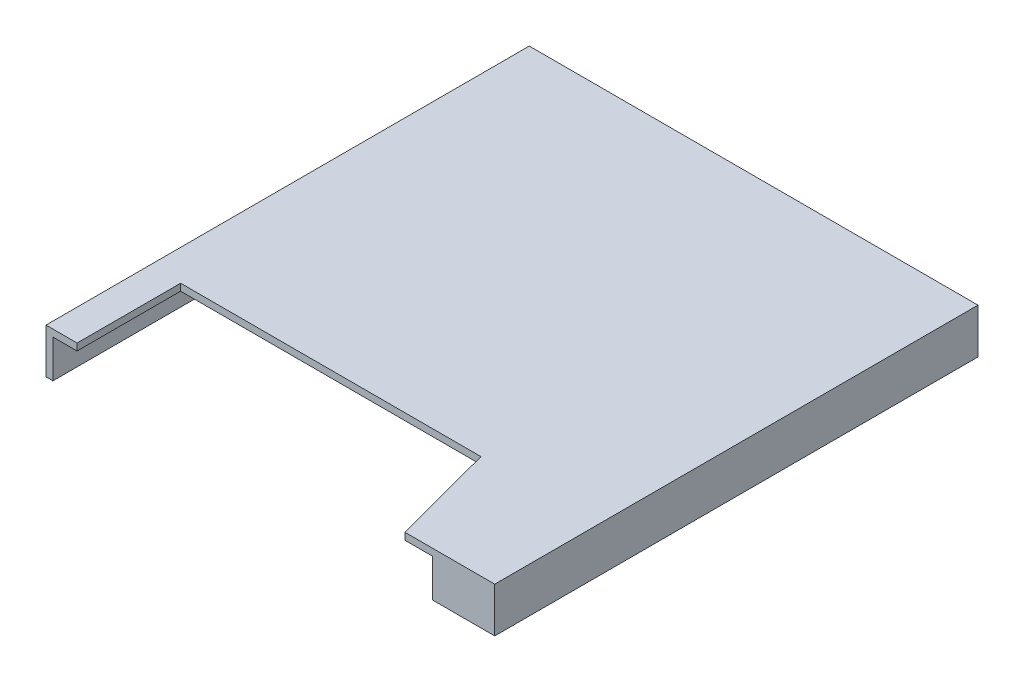
ISO-10303-21;
HEADER;
FILE_DESCRIPTION(('STEP AP214'),'2;1');
FILE_NAME('part.step','',(''),(''),'','','');
FILE_SCHEMA(('AUTOMOTIVE_DESIGN { 1 0 10303 214 1 1 1 1 }'));
ENDSEC;
DATA;
#1=APPLICATION_CONTEXT('core data for automotive mechanical design processes');
#2=APPLICATION_PROTOCOL_DEFINITION('international standard','automotive_design',2000,#1);
#3=PRODUCT_CONTEXT('',#1,'mechanical');
#4=PRODUCT('Part','Part','',(#3));
#5=PRODUCT_RELATED_PRODUCT_CATEGORY('part','',(#4));
#6=PRODUCT_DEFINITION_FORMATION('','',#4);
#7=PRODUCT_DEFINITION_CONTEXT('part definition',#1,'design');
#8=PRODUCT_DEFINITION('design','',#6,#7);
#9=PRODUCT_DEFINITION_SHAPE('','',#8);
#10=(LENGTH_UNIT() NAMED_UNIT(*) SI_UNIT(.MILLI.,.METRE.));
#11=(NAMED_UNIT(*) PLANE_ANGLE_UNIT() SI_UNIT($,.RADIAN.));
#12=(NAMED_UNIT(*) SI_UNIT($,.STERADIAN.) SOLID_ANGLE_UNIT());
#13=UNCERTAINTY_MEASURE_WITH_UNIT(LENGTH_MEASURE(1.E-05),#10,'distance_accuracy_value','');
#14=(GEOMETRIC_REPRESENTATION_CONTEXT(3) GLOBAL_UNCERTAINTY_ASSIGNED_CONTEXT((#13)) GLOBAL_UNIT_ASSIGNED_CONTEXT((#10,
#11,#12)) REPRESENTATION_CONTEXT('',''));
#15=CARTESIAN_POINT('',(0.,0.,0.));
#16=DIRECTION('',(0.,0.,1.));
#17=DIRECTION('',(1.,0.,0.));
#18=AXIS2_PLACEMENT_3D('',#15,#16,#17);
#19=CARTESIAN_POINT('',(-6.3,0.,-7.));
#20=DIRECTION('',(-1.,0.,0.));
#21=DIRECTION('',(0.,0.,1.));
#22=AXIS2_PLACEMENT_3D('',#19,#20,#21);
#23=PLANE('',#22);
#24=DIRECTION('',(0.,0.,1.));
#25=VECTOR('',#24,1.);
#26=CARTESIAN_POINT('',(-6.3,1.1,0.));
#27=LINE('',#26,#25);
#28=CARTESIAN_POINT('',(-6.3,1.1,-6.8));
#29=VERTEX_POINT('',#28);
#30=CARTESIAN_POINT('',(-6.3,1.1,7.));
#31=VERTEX_POINT('',#30);
#32=EDGE_CURVE('E143',#29,#31,#27,.T.);
#33=ORIENTED_EDGE('',*,*,#32,.T.);
#34=DIRECTION('',(0.,1.,0.));
#35=VECTOR('',#34,1.);
#36=CARTESIAN_POINT('',(-6.3,0.,7.));
#37=LINE('',#36,#35);
#38=CARTESIAN_POINT('',(-6.3,0.,7.));
#39=VERTEX_POINT('',#38);
#40=EDGE_CURVE('E19',#39,#31,#37,.T.);
#41=ORIENTED_EDGE('',*,*,#40,.F.);
#42=DIRECTION('',(0.,0.,1.));
#43=VECTOR('',#42,1.);
#44=CARTESIAN_POINT('',(-6.3,0.,0.));
#45=LINE('',#44,#43);
#46=CARTESIAN_POINT('',(-6.3,0.,-6.8));
#47=VERTEX_POINT('',#46);
#48=EDGE_CURVE('E179',#39,#47,#45,.F.);
#49=ORIENTED_EDGE('',*,*,#48,.T.);
#50=DIRECTION('',(0.,1.,0.));
#51=VECTOR('',#50,1.);
#52=CARTESIAN_POINT('',(-6.3,0.,-6.8));
#53=LINE('',#52,#51);
#54=EDGE_CURVE('E147',#47,#29,#53,.T.);
#55=ORIENTED_EDGE('',*,*,#54,.T.);
#56=EDGE_LOOP('',(#33,#41,#49,#55));
#57=FACE_BOUND('',#56,.T.);
#58=ADVANCED_FACE('F16',(#57),#23,.F.);
#59=CARTESIAN_POINT('',(6.5,0.,-6.8));
#60=DIRECTION('',(0.,0.,-1.));
#61=DIRECTION('',(-1.,0.,0.));
#62=AXIS2_PLACEMENT_3D('',#59,#60,#61);
#63=PLANE('',#62);
#64=DIRECTION('',(1.,0.,0.));
#65=VECTOR('',#64,1.);
#66=CARTESIAN_POINT('',(0.,1.1,-6.8));
#67=LINE('',#66,#65);
#68=CARTESIAN_POINT('',(6.3,1.1,-6.8));
#69=VERTEX_POINT('',#68);
#70=EDGE_CURVE('E141',#69,#29,#67,.F.);
#71=ORIENTED_EDGE('',*,*,#70,.T.);
#72=ORIENTED_EDGE('',*,*,#54,.F.);
#73=DIRECTION('',(1.,0.,0.));
#74=VECTOR('',#73,1.);
#75=CARTESIAN_POINT('',(0.,0.,-6.8));
#76=LINE('',#75,#74);
#77=CARTESIAN_POINT('',(6.3,0.,-6.8));
#78=VERTEX_POINT('',#77);
#79=EDGE_CURVE('E177',#47,#78,#76,.T.);
#80=ORIENTED_EDGE('',*,*,#79,.T.);
#81=DIRECTION('',(0.,1.,0.));
#82=VECTOR('',#81,1.);
#83=CARTESIAN_POINT('',(6.3,0.,-6.8));
#84=LINE('',#83,#82);
#85=EDGE_CURVE('E114',#78,#69,#84,.T.);
#86=ORIENTED_EDGE('',*,*,#85,.T.);
#87=EDGE_LOOP('',(#71,#72,#80,#86));
#88=FACE_BOUND('',#87,.T.);
#89=ADVANCED_FACE('F422',(#88),#63,.F.);
#90=CARTESIAN_POINT('',(6.3,0.,7.));
#91=DIRECTION('',(1.,0.,0.));
#92=DIRECTION('',(0.,0.,-1.));
#93=AXIS2_PLACEMENT_3D('',#90,#91,#92);
#94=PLANE('',#93);
#95=ORIENTED_EDGE('',*,*,#85,.F.);
#96=DIRECTION('',(0.,0.,1.));
#97=VECTOR('',#96,1.);
#98=CARTESIAN_POINT('',(6.3,0.,0.));
#99=LINE('',#98,#97);
#100=CARTESIAN_POINT('',(6.3,0.,6.8));
#101=VERTEX_POINT('',#100);
#102=EDGE_CURVE('E126',#78,#101,#99,.T.);
#103=ORIENTED_EDGE('',*,*,#102,.T.);
#104=DIRECTION('',(0.,1.,0.));
#105=VECTOR('',#104,1.);
#106=CARTESIAN_POINT('',(6.3,1.1,6.8));
#107=LINE('',#106,#105);
#108=CARTESIAN_POINT('',(6.3,1.1,6.8));
#109=VERTEX_POINT('',#108);
#110=EDGE_CURVE('E119',#109,#101,#107,.F.);
#111=ORIENTED_EDGE('',*,*,#110,.F.);
#112=DIRECTION('',(0.,0.,1.));
#113=VECTOR('',#112,1.);
#114=CARTESIAN_POINT('',(6.3,1.1,0.));
#115=LINE('',#114,#113);
#116=EDGE_CURVE('E123',#109,#69,#115,.F.);
#117=ORIENTED_EDGE('',*,*,#116,.T.);
#118=EDGE_LOOP('',(#95,#103,#111,#117));
#119=FACE_BOUND('',#118,.T.);
#120=ADVANCED_FACE('F121',(#119),#94,.F.);
#121=CARTESIAN_POINT('',(4.7,1.1,6.8));
#122=DIRECTION('',(0.,0.,-1.));
#123=DIRECTION('',(-1.,0.,0.));
#124=AXIS2_PLACEMENT_3D('',#121,#122,#123);
#125=PLANE('',#124);
#126=DIRECTION('',(1.,0.,0.));
#127=VECTOR('',#126,1.);
#128=CARTESIAN_POINT('',(0.,0.,6.8));
#129=LINE('',#128,#127);
#130=CARTESIAN_POINT('',(4.7,0.,6.8));
#131=VERTEX_POINT('',#130);
#132=EDGE_CURVE('E174',#101,#131,#129,.F.);
#133=ORIENTED_EDGE('',*,*,#132,.T.);
#134=DIRECTION('',(0.,1.,0.));
#135=VECTOR('',#134,1.);
#136=CARTESIAN_POINT('',(4.7,1.1,6.8));
#137=LINE('',#136,#135);
#138=CARTESIAN_POINT('',(4.7,1.1,6.8));
#139=VERTEX_POINT('',#138);
#140=EDGE_CURVE('E134',#139,#131,#137,.F.);
#141=ORIENTED_EDGE('',*,*,#140,.F.);
#142=DIRECTION('',(1.,0.,0.));
#143=VECTOR('',#142,1.);
#144=CARTESIAN_POINT('',(0.,1.1,6.8));
#145=LINE('',#144,#143);
#146=EDGE_CURVE('E129',#139,#109,#145,.T.);
#147=ORIENTED_EDGE('',*,*,#146,.T.);
#148=ORIENTED_EDGE('',*,*,#110,.T.);
#149=EDGE_LOOP('',(#133,#141,#147,#148));
#150=FACE_BOUND('',#149,.T.);
#151=ADVANCED_FACE('F132',(#150),#125,.T.);
#152=CARTESIAN_POINT('',(0.,1.1,0.));
#153=DIRECTION('',(0.,1.,0.));
#154=DIRECTION('',(0.,0.,1.));
#155=AXIS2_PLACEMENT_3D('',#152,#153,#154);
#156=PLANE('',#155);
#157=DIRECTION('',(1.,0.,0.));
#158=VECTOR('',#157,1.);
#159=CARTESIAN_POINT('',(0.,1.1,7.));
#160=LINE('',#159,#158);
#161=CARTESIAN_POINT('',(3.9,1.1,7.));
#162=VERTEX_POINT('',#161);
#163=CARTESIAN_POINT('',(4.7,1.1,7.));
#164=VERTEX_POINT('',#163);
#165=EDGE_CURVE('E162',#162,#164,#160,.T.);
#166=ORIENTED_EDGE('',*,*,#165,.F.);
#167=DIRECTION('',(-0.257662650560333,0.,-0.966234939601246));
#168=VECTOR('',#167,1.);
#169=CARTESIAN_POINT('',(3.1,1.1,4.));
#170=LINE('',#169,#168);
#171=CARTESIAN_POINT('',(3.1,1.1,4.));
#172=VERTEX_POINT('',#171);
#173=EDGE_CURVE('E206',#162,#172,#170,.T.);
#174=ORIENTED_EDGE('',*,*,#173,.T.);
#175=DIRECTION('',(-1.,0.,0.));
#176=VECTOR('',#175,1.);
#177=CARTESIAN_POINT('',(-5.6,1.1,4.));
#178=LINE('',#177,#176);
#179=CARTESIAN_POINT('',(-5.6,1.1,4.));
#180=VERTEX_POINT('',#179);
#181=EDGE_CURVE('E210',#172,#180,#178,.T.);
#182=ORIENTED_EDGE('',*,*,#181,.T.);
#183=DIRECTION('',(0.,0.,1.));
#184=VECTOR('',#183,1.);
#185=CARTESIAN_POINT('',(-5.6,1.1,7.));
#186=LINE('',#185,#184);
#187=CARTESIAN_POINT('',(-5.6,1.1,7.));
#188=VERTEX_POINT('',#187);
#189=EDGE_CURVE('E164',#180,#188,#186,.T.);
#190=ORIENTED_EDGE('',*,*,#189,.T.);
#191=DIRECTION('',(1.,0.,0.));
#192=VECTOR('',#191,1.);
#193=CARTESIAN_POINT('',(-6.5,1.1,7.));
#194=LINE('',#193,#192);
#195=EDGE_CURVE('E157',#31,#188,#194,.T.);
#196=ORIENTED_EDGE('',*,*,#195,.F.);
#197=ORIENTED_EDGE('',*,*,#32,.F.);
#198=ORIENTED_EDGE('',*,*,#70,.F.);
#199=ORIENTED_EDGE('',*,*,#116,.F.);
#200=ORIENTED_EDGE('',*,*,#146,.F.);
#201=DIRECTION('',(0.,0.,1.));
#202=VECTOR('',#201,1.);
#203=CARTESIAN_POINT('',(4.7,1.1,7.));
#204=LINE('',#203,#202);
#205=EDGE_CURVE('E182',#164,#139,#204,.F.);
#206=ORIENTED_EDGE('',*,*,#205,.F.);
#207=EDGE_LOOP('',(#166,#174,#182,#190,#196,#197,#198,#199,#200,#206));
#208=FACE_BOUND('',#207,.T.);
#209=ADVANCED_FACE('F139',(#208),#156,.F.);
#210=CARTESIAN_POINT('',(4.7,1.1,7.));
#211=DIRECTION('',(-1.,0.,0.));
#212=DIRECTION('',(0.,0.,1.));
#213=AXIS2_PLACEMENT_3D('',#210,#211,#212);
#214=PLANE('',#213);
#215=DIRECTION('',(0.,0.,1.));
#216=VECTOR('',#215,1.);
#217=CARTESIAN_POINT('',(4.7,0.,0.));
#218=LINE('',#217,#216);
#219=CARTESIAN_POINT('',(4.7,0.,7.));
#220=VERTEX_POINT('',#219);
#221=EDGE_CURVE('E169',#131,#220,#218,.T.);
#222=ORIENTED_EDGE('',*,*,#221,.T.);
#223=DIRECTION('',(0.,1.,0.));
#224=VECTOR('',#223,1.);
#225=CARTESIAN_POINT('',(4.7,0.,7.));
#226=LINE('',#225,#224);
#227=EDGE_CURVE('E189',#164,#220,#226,.F.);
#228=ORIENTED_EDGE('',*,*,#227,.F.);
#229=ORIENTED_EDGE('',*,*,#205,.T.);
#230=ORIENTED_EDGE('',*,*,#140,.T.);
#231=EDGE_LOOP('',(#222,#228,#229,#230));
#232=FACE_BOUND('',#231,.T.);
#233=ADVANCED_FACE('F194',(#232),#214,.T.);
#234=CARTESIAN_POINT('',(0.,0.,0.));
#235=DIRECTION('',(0.,1.,0.));
#236=DIRECTION('',(0.,0.,1.));
#237=AXIS2_PLACEMENT_3D('',#234,#235,#236);
#238=PLANE('',#237);
#239=DIRECTION('',(0.,0.,1.));
#240=VECTOR('',#239,1.);
#241=CARTESIAN_POINT('',(-6.5,0.,-7.));
#242=LINE('',#241,#240);
#243=CARTESIAN_POINT('',(-6.5,0.,-7.));
#244=VERTEX_POINT('',#243);
#245=CARTESIAN_POINT('',(-6.5,0.,7.));
#246=VERTEX_POINT('',#245);
#247=EDGE_CURVE('E166',#244,#246,#242,.T.);
#248=ORIENTED_EDGE('',*,*,#247,.F.);
#249=DIRECTION('',(-1.,0.,0.));
#250=VECTOR('',#249,1.);
#251=CARTESIAN_POINT('',(6.5,0.,-7.));
#252=LINE('',#251,#250);
#253=CARTESIAN_POINT('',(6.5,0.,-7.));
#254=VERTEX_POINT('',#253);
#255=EDGE_CURVE('E239',#254,#244,#252,.T.);
#256=ORIENTED_EDGE('',*,*,#255,.F.);
#257=DIRECTION('',(0.,0.,-1.));
#258=VECTOR('',#257,1.);
#259=CARTESIAN_POINT('',(6.5,0.,7.));
#260=LINE('',#259,#258);
#261=CARTESIAN_POINT('',(6.5,0.,7.));
#262=VERTEX_POINT('',#261);
#263=EDGE_CURVE('E243',#262,#254,#260,.T.);
#264=ORIENTED_EDGE('',*,*,#263,.F.);
#265=DIRECTION('',(1.,0.,0.));
#266=VECTOR('',#265,1.);
#267=CARTESIAN_POINT('',(-6.5,0.,7.));
#268=LINE('',#267,#266);
#269=EDGE_CURVE('E197',#220,#262,#268,.T.);
#270=ORIENTED_EDGE('',*,*,#269,.F.);
#271=ORIENTED_EDGE('',*,*,#221,.F.);
#272=ORIENTED_EDGE('',*,*,#132,.F.);
#273=ORIENTED_EDGE('',*,*,#102,.F.);
#274=ORIENTED_EDGE('',*,*,#79,.F.);
#275=ORIENTED_EDGE('',*,*,#48,.F.);
#276=DIRECTION('',(1.,0.,0.));
#277=VECTOR('',#276,1.);
#278=CARTESIAN_POINT('',(-6.5,0.,7.));
#279=LINE('',#278,#277);
#280=EDGE_CURVE('E160',#246,#39,#279,.T.);
#281=ORIENTED_EDGE('',*,*,#280,.F.);
#282=EDGE_LOOP('',(#248,#256,#264,#270,#271,#272,#273,#274,#275,#281));
#283=FACE_BOUND('',#282,.T.);
#284=ADVANCED_FACE('F252',(#283),#238,.F.);
#285=CARTESIAN_POINT('',(-6.5,0.,-7.));
#286=DIRECTION('',(-1.,0.,0.));
#287=DIRECTION('',(0.,0.,1.));
#288=AXIS2_PLACEMENT_3D('',#285,#286,#287);
#289=PLANE('',#288);
#290=ORIENTED_EDGE('',*,*,#247,.T.);
#291=DIRECTION('',(0.,1.,0.));
#292=VECTOR('',#291,1.);
#293=CARTESIAN_POINT('',(-6.5,0.,7.));
#294=LINE('',#293,#292);
#295=CARTESIAN_POINT('',(-6.5,1.3,7.));
#296=VERTEX_POINT('',#295);
#297=EDGE_CURVE('E165',#296,#246,#294,.F.);
#298=ORIENTED_EDGE('',*,*,#297,.F.);
#299=DIRECTION('',(0.,0.,1.));
#300=VECTOR('',#299,1.);
#301=CARTESIAN_POINT('',(-6.5,1.3,0.));
#302=LINE('',#301,#300);
#303=CARTESIAN_POINT('',(-6.5,1.3,-7.));
#304=VERTEX_POINT('',#303);
#305=EDGE_CURVE('E231',#304,#296,#302,.T.);
#306=ORIENTED_EDGE('',*,*,#305,.F.);
#307=DIRECTION('',(0.,1.,0.));
#308=VECTOR('',#307,1.);
#309=CARTESIAN_POINT('',(-6.5,0.,-7.));
#310=LINE('',#309,#308);
#311=EDGE_CURVE('E233',#244,#304,#310,.T.);
#312=ORIENTED_EDGE('',*,*,#311,.F.);
#313=EDGE_LOOP('',(#290,#298,#306,#312));
#314=FACE_BOUND('',#313,.T.);
#315=ADVANCED_FACE('F360',(#314),#289,.T.);
#316=CARTESIAN_POINT('',(-6.5,0.,7.));
#317=DIRECTION('',(0.,0.,1.));
#318=DIRECTION('',(1.,0.,0.));
#319=AXIS2_PLACEMENT_3D('',#316,#317,#318);
#320=PLANE('',#319);
#321=ORIENTED_EDGE('',*,*,#297,.T.);
#322=ORIENTED_EDGE('',*,*,#280,.T.);
#323=ORIENTED_EDGE('',*,*,#40,.T.);
#324=ORIENTED_EDGE('',*,*,#195,.T.);
#325=DIRECTION('',(0.,1.,0.));
#326=VECTOR('',#325,1.);
#327=CARTESIAN_POINT('',(-5.6,1.3,7.));
#328=LINE('',#327,#326);
#329=CARTESIAN_POINT('',(-5.6,1.3,7.));
#330=VERTEX_POINT('',#329);
#331=EDGE_CURVE('E212',#188,#330,#328,.T.);
#332=ORIENTED_EDGE('',*,*,#331,.T.);
#333=DIRECTION('',(1.,0.,0.));
#334=VECTOR('',#333,1.);
#335=CARTESIAN_POINT('',(0.,1.3,7.));
#336=LINE('',#335,#334);
#337=EDGE_CURVE('E217',#296,#330,#336,.T.);
#338=ORIENTED_EDGE('',*,*,#337,.F.);
#339=EDGE_LOOP('',(#321,#322,#323,#324,#332,#338));
#340=FACE_BOUND('',#339,.T.);
#341=ADVANCED_FACE('F155',(#340),#320,.T.);
#342=CARTESIAN_POINT('',(-5.6,1.3,7.));
#343=DIRECTION('',(-1.,0.,0.));
#344=DIRECTION('',(0.,0.,1.));
#345=AXIS2_PLACEMENT_3D('',#342,#343,#344);
#346=PLANE('',#345);
#347=DIRECTION('',(0.,0.,1.));
#348=VECTOR('',#347,1.);
#349=CARTESIAN_POINT('',(-5.6,1.3,0.));
#350=LINE('',#349,#348);
#351=CARTESIAN_POINT('',(-5.6,1.3,4.));
#352=VERTEX_POINT('',#351);
#353=EDGE_CURVE('E221',#330,#352,#350,.F.);
#354=ORIENTED_EDGE('',*,*,#353,.F.);
#355=ORIENTED_EDGE('',*,*,#331,.F.);
#356=ORIENTED_EDGE('',*,*,#189,.F.);
#357=DIRECTION('',(0.,1.,0.));
#358=VECTOR('',#357,1.);
#359=CARTESIAN_POINT('',(-5.6,1.3,4.));
#360=LINE('',#359,#358);
#361=EDGE_CURVE('E208',#180,#352,#360,.T.);
#362=ORIENTED_EDGE('',*,*,#361,.T.);
#363=EDGE_LOOP('',(#354,#355,#356,#362));
#364=FACE_BOUND('',#363,.T.);
#365=ADVANCED_FACE('F222',(#364),#346,.F.);
#366=CARTESIAN_POINT('',(-5.6,1.3,4.));
#367=DIRECTION('',(0.,0.,-1.));
#368=DIRECTION('',(-1.,0.,0.));
#369=AXIS2_PLACEMENT_3D('',#366,#367,#368);
#370=PLANE('',#369);
#371=DIRECTION('',(1.,0.,0.));
#372=VECTOR('',#371,1.);
#373=CARTESIAN_POINT('',(0.,1.3,4.));
#374=LINE('',#373,#372);
#375=CARTESIAN_POINT('',(3.1,1.3,4.));
#376=VERTEX_POINT('',#375);
#377=EDGE_CURVE('E227',#352,#376,#374,.T.);
#378=ORIENTED_EDGE('',*,*,#377,.F.);
#379=ORIENTED_EDGE('',*,*,#361,.F.);
#380=ORIENTED_EDGE('',*,*,#181,.F.);
#381=DIRECTION('',(0.,1.,0.));
#382=VECTOR('',#381,1.);
#383=CARTESIAN_POINT('',(3.1,1.3,4.));
#384=LINE('',#383,#382);
#385=EDGE_CURVE('E201',#172,#376,#384,.T.);
#386=ORIENTED_EDGE('',*,*,#385,.T.);
#387=EDGE_LOOP('',(#378,#379,#380,#386));
#388=FACE_BOUND('',#387,.T.);
#389=ADVANCED_FACE('F262',(#388),#370,.F.);
#390=CARTESIAN_POINT('',(3.1,1.3,4.));
#391=DIRECTION('',(0.966234939601246,0.,-0.257662650560333));
#392=DIRECTION('',(-0.257662650560333,0.,-0.966234939601246));
#393=AXIS2_PLACEMENT_3D('',#390,#391,#392);
#394=PLANE('',#393);
#395=DIRECTION('',(0.257662650560332,0.,0.966234939601246));
#396=VECTOR('',#395,1.);
#397=CARTESIAN_POINT('',(3.1,1.3,4.));
#398=LINE('',#397,#396);
#399=CARTESIAN_POINT('',(3.9,1.3,7.));
#400=VERTEX_POINT('',#399);
#401=EDGE_CURVE('E257',#376,#400,#398,.T.);
#402=ORIENTED_EDGE('',*,*,#401,.F.);
#403=ORIENTED_EDGE('',*,*,#385,.F.);
#404=ORIENTED_EDGE('',*,*,#173,.F.);
#405=DIRECTION('',(0.,1.,0.));
#406=VECTOR('',#405,1.);
#407=CARTESIAN_POINT('',(3.9,0.,7.));
#408=LINE('',#407,#406);
#409=EDGE_CURVE('E191',#400,#162,#408,.F.);
#410=ORIENTED_EDGE('',*,*,#409,.F.);
#411=EDGE_LOOP('',(#402,#403,#404,#410));
#412=FACE_BOUND('',#411,.T.);
#413=ADVANCED_FACE('F266',(#412),#394,.F.);
#414=CARTESIAN_POINT('',(-6.5,0.,7.));
#415=DIRECTION('',(0.,0.,1.));
#416=DIRECTION('',(1.,0.,0.));
#417=AXIS2_PLACEMENT_3D('',#414,#415,#416);
#418=PLANE('',#417);
#419=ORIENTED_EDGE('',*,*,#227,.T.);
#420=ORIENTED_EDGE('',*,*,#269,.T.);
#421=DIRECTION('',(0.,1.,0.));
#422=VECTOR('',#421,1.);
#423=CARTESIAN_POINT('',(6.5,0.,7.));
#424=LINE('',#423,#422);
#425=CARTESIAN_POINT('',(6.5,1.3,7.));
#426=VERTEX_POINT('',#425);
#427=EDGE_CURVE('E199',#426,#262,#424,.F.);
#428=ORIENTED_EDGE('',*,*,#427,.F.);
#429=DIRECTION('',(1.,0.,0.));
#430=VECTOR('',#429,1.);
#431=CARTESIAN_POINT('',(0.,1.3,7.));
#432=LINE('',#431,#430);
#433=EDGE_CURVE('E249',#400,#426,#432,.T.);
#434=ORIENTED_EDGE('',*,*,#433,.F.);
#435=ORIENTED_EDGE('',*,*,#409,.T.);
#436=ORIENTED_EDGE('',*,*,#165,.T.);
#437=EDGE_LOOP('',(#419,#420,#428,#434,#435,#436));
#438=FACE_BOUND('',#437,.T.);
#439=ADVANCED_FACE('F187',(#438),#418,.T.);
#440=CARTESIAN_POINT('',(6.5,0.,7.));
#441=DIRECTION('',(1.,0.,0.));
#442=DIRECTION('',(0.,0.,-1.));
#443=AXIS2_PLACEMENT_3D('',#440,#441,#442);
#444=PLANE('',#443);
#445=ORIENTED_EDGE('',*,*,#263,.T.);
#446=DIRECTION('',(0.,1.,0.));
#447=VECTOR('',#446,1.);
#448=CARTESIAN_POINT('',(6.5,0.,-7.));
#449=LINE('',#448,#447);
#450=CARTESIAN_POINT('',(6.5,1.3,-7.));
#451=VERTEX_POINT('',#450);
#452=EDGE_CURVE('E34',#451,#254,#449,.F.);
#453=ORIENTED_EDGE('',*,*,#452,.F.);
#454=DIRECTION('',(0.,0.,1.));
#455=VECTOR('',#454,1.);
#456=CARTESIAN_POINT('',(6.5,1.3,0.));
#457=LINE('',#456,#455);
#458=EDGE_CURVE('E25',#426,#451,#457,.F.);
#459=ORIENTED_EDGE('',*,*,#458,.F.);
#460=ORIENTED_EDGE('',*,*,#427,.T.);
#461=EDGE_LOOP('',(#445,#453,#459,#460));
#462=FACE_BOUND('',#461,.T.);
#463=ADVANCED_FACE('F245',(#462),#444,.T.);
#464=CARTESIAN_POINT('',(6.5,0.,-7.));
#465=DIRECTION('',(0.,0.,-1.));
#466=DIRECTION('',(-1.,0.,0.));
#467=AXIS2_PLACEMENT_3D('',#464,#465,#466);
#468=PLANE('',#467);
#469=ORIENTED_EDGE('',*,*,#255,.T.);
#470=ORIENTED_EDGE('',*,*,#311,.T.);
#471=DIRECTION('',(1.,0.,0.));
#472=VECTOR('',#471,1.);
#473=CARTESIAN_POINT('',(0.,1.3,-7.));
#474=LINE('',#473,#472);
#475=EDGE_CURVE('E11',#451,#304,#474,.F.);
#476=ORIENTED_EDGE('',*,*,#475,.F.);
#477=ORIENTED_EDGE('',*,*,#452,.T.);
#478=EDGE_LOOP('',(#469,#470,#476,#477));
#479=FACE_BOUND('',#478,.T.);
#480=ADVANCED_FACE('F255',(#479),#468,.T.);
#481=CARTESIAN_POINT('',(0.,1.3,0.));
#482=DIRECTION('',(0.,1.,0.));
#483=DIRECTION('',(0.,0.,1.));
#484=AXIS2_PLACEMENT_3D('',#481,#482,#483);
#485=PLANE('',#484);
#486=ORIENTED_EDGE('',*,*,#458,.T.);
#487=ORIENTED_EDGE('',*,*,#475,.T.);
#488=ORIENTED_EDGE('',*,*,#305,.T.);
#489=ORIENTED_EDGE('',*,*,#337,.T.);
#490=ORIENTED_EDGE('',*,*,#353,.T.);
#491=ORIENTED_EDGE('',*,*,#377,.T.);
#492=ORIENTED_EDGE('',*,*,#401,.T.);
#493=ORIENTED_EDGE('',*,*,#433,.T.);
#494=EDGE_LOOP('',(#486,#487,#488,#489,#490,#491,#492,#493));
#495=FACE_BOUND('',#494,.T.);
#496=ADVANCED_FACE('F230',(#495),#485,.T.);
#497=CLOSED_SHELL('',(#58,#89,#120,#151,#209,#233,#284,#315,#341,#365,#389,#413,#439,#463,#480,#496));
#498=MANIFOLD_SOLID_BREP('B1',#497);
#499=ADVANCED_BREP_SHAPE_REPRESENTATION('',(#18,#498),#14);
#500=SHAPE_DEFINITION_REPRESENTATION(#9,#499);
ENDSEC;
END-ISO-10303-21;
